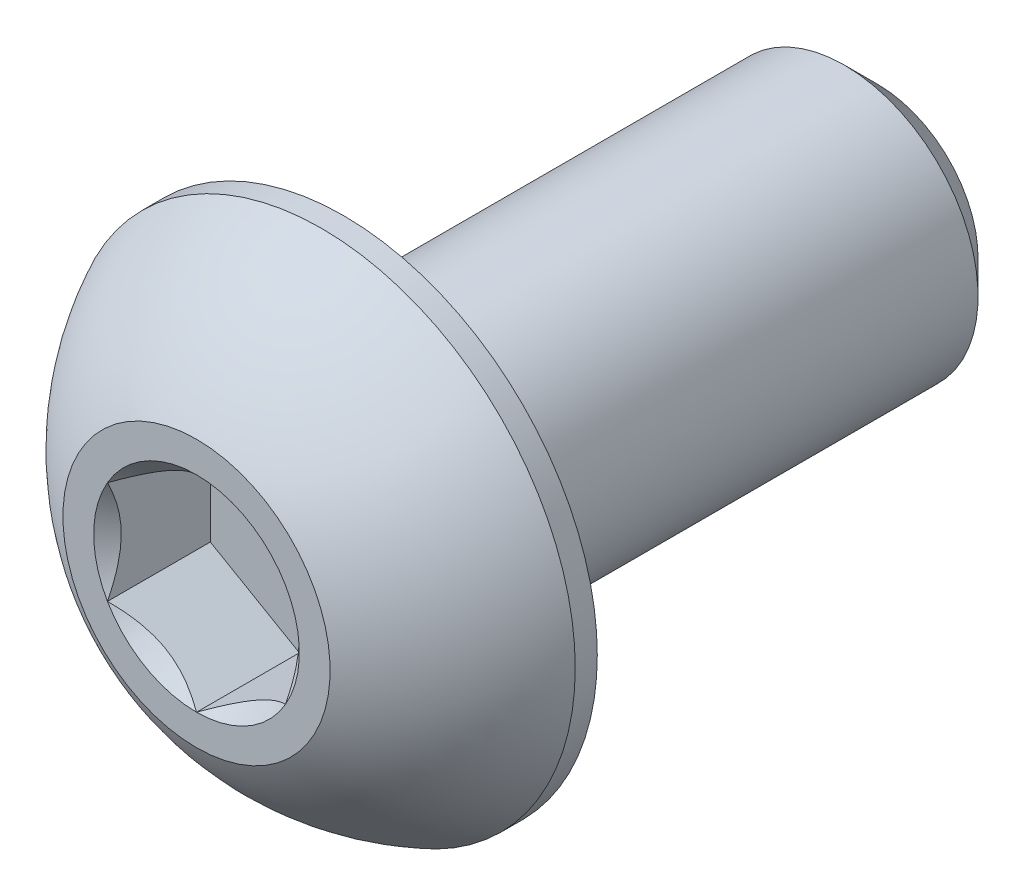
ISO-10303-21;
HEADER;
FILE_DESCRIPTION(('STEP AP214'),'2;1');
FILE_NAME('part.step','',(''),(''),'','','');
FILE_SCHEMA(('AUTOMOTIVE_DESIGN { 1 0 10303 214 1 1 1 1 }'));
ENDSEC;
DATA;
#1=APPLICATION_CONTEXT('core data for automotive mechanical design processes');
#2=APPLICATION_PROTOCOL_DEFINITION('international standard','automotive_design',2000,#1);
#3=PRODUCT_CONTEXT('',#1,'mechanical');
#4=PRODUCT('Part','Part','',(#3));
#5=PRODUCT_RELATED_PRODUCT_CATEGORY('part','',(#4));
#6=PRODUCT_DEFINITION_FORMATION('','',#4);
#7=PRODUCT_DEFINITION_CONTEXT('part definition',#1,'design');
#8=PRODUCT_DEFINITION('design','',#6,#7);
#9=PRODUCT_DEFINITION_SHAPE('','',#8);
#10=(LENGTH_UNIT() NAMED_UNIT(*) SI_UNIT(.MILLI.,.METRE.));
#11=(NAMED_UNIT(*) PLANE_ANGLE_UNIT() SI_UNIT($,.RADIAN.));
#12=(NAMED_UNIT(*) SI_UNIT($,.STERADIAN.) SOLID_ANGLE_UNIT());
#13=UNCERTAINTY_MEASURE_WITH_UNIT(LENGTH_MEASURE(1.E-05),#10,'distance_accuracy_value','');
#14=(GEOMETRIC_REPRESENTATION_CONTEXT(3) GLOBAL_UNCERTAINTY_ASSIGNED_CONTEXT((#13)) GLOBAL_UNIT_ASSIGNED_CONTEXT((#10,
#11,#12)) REPRESENTATION_CONTEXT('',''));
#15=CARTESIAN_POINT('',(0.,0.,0.));
#16=DIRECTION('',(0.,0.,1.));
#17=DIRECTION('',(1.,0.,0.));
#18=AXIS2_PLACEMENT_3D('',#15,#16,#17);
#19=CARTESIAN_POINT('',(0.,-1.50000000000001,-7.65));
#20=DIRECTION('',(0.,0.,-1.));
#21=DIRECTION('',(0.,1.,0.));
#22=AXIS2_PLACEMENT_3D('',#19,#20,#21);
#23=PLANE('',#22);
#24=CARTESIAN_POINT('',(0.,0.,-7.65));
#25=DIRECTION('',(0.,0.,-1.));
#26=DIRECTION('',(0.,1.,0.));
#27=AXIS2_PLACEMENT_3D('',#24,#25,#26);
#28=CIRCLE('',#27,1.12500000000001);
#29=CARTESIAN_POINT('',(0.,1.12500000000001,-7.65));
#30=VERTEX_POINT('',#29);
#31=EDGE_CURVE('E174',#30,#30,#28,.T.);
#32=ORIENTED_EDGE('',*,*,#31,.T.);
#33=EDGE_LOOP('',(#32));
#34=FACE_BOUND('',#33,.T.);
#35=ADVANCED_FACE('F35',(#34),#23,.T.);
#36=CARTESIAN_POINT('',(0.,0.,-7.65));
#37=DIRECTION('',(0.,0.,-1.));
#38=DIRECTION('',(0.,1.,0.));
#39=AXIS2_PLACEMENT_3D('',#36,#37,#38);
#40=CYLINDRICAL_SURFACE('',#39,1.50000000000001);
#41=CARTESIAN_POINT('',(0.,0.,-7.275));
#42=DIRECTION('',(0.,0.,-1.));
#43=DIRECTION('',(0.,1.,0.));
#44=AXIS2_PLACEMENT_3D('',#41,#42,#43);
#45=CIRCLE('',#44,1.50000000000001);
#46=CARTESIAN_POINT('',(0.,1.50000000000001,-7.275));
#47=VERTEX_POINT('',#46);
#48=EDGE_CURVE('E48',#47,#47,#45,.F.);
#49=ORIENTED_EDGE('',*,*,#48,.T.);
#50=EDGE_LOOP('',(#49));
#51=FACE_BOUND('',#50,.T.);
#52=CARTESIAN_POINT('',(0.,0.,-1.65));
#53=DIRECTION('',(0.,0.,1.));
#54=DIRECTION('',(1.,0.,0.));
#55=AXIS2_PLACEMENT_3D('',#52,#53,#54);
#56=CIRCLE('',#55,1.50000000000001);
#57=CARTESIAN_POINT('',(1.50000000000001,0.,-1.65));
#58=VERTEX_POINT('',#57);
#59=EDGE_CURVE('E171',#58,#58,#56,.F.);
#60=ORIENTED_EDGE('',*,*,#59,.T.);
#61=EDGE_LOOP('',(#60));
#62=FACE_BOUND('',#61,.T.);
#63=ADVANCED_FACE('F179',(#51,#62),#40,.T.);
#64=CARTESIAN_POINT('',(0.,0.,-7.65));
#65=DIRECTION('',(0.,0.,1.));
#66=DIRECTION('',(0.,-1.,0.));
#67=AXIS2_PLACEMENT_3D('',#64,#65,#66);
#68=CONICAL_SURFACE('',#67,1.12500000000001,0.785398163397448);
#69=ORIENTED_EDGE('',*,*,#48,.F.);
#70=EDGE_LOOP('',(#69));
#71=FACE_BOUND('',#70,.T.);
#72=ORIENTED_EDGE('',*,*,#31,.F.);
#73=EDGE_LOOP('',(#72));
#74=FACE_BOUND('',#73,.T.);
#75=ADVANCED_FACE('F37',(#71,#74),#68,.T.);
#76=CARTESIAN_POINT('',(0.,0.,-2.79483288770053));
#77=DIRECTION('',(0.,0.,1.));
#78=DIRECTION('',(0.,-1.,0.));
#79=AXIS2_PLACEMENT_3D('',#76,#77,#78);
#80=SPHERICAL_SURFACE('',#79,3.17192226735974);
#81=CARTESIAN_POINT('',(0.,0.,0.));
#82=DIRECTION('',(0.,0.,1.));
#83=DIRECTION('',(1.,0.,0.));
#84=AXIS2_PLACEMENT_3D('',#81,#82,#83);
#85=CIRCLE('',#84,1.50000000000001);
#86=CARTESIAN_POINT('',(0.,-1.50000000000001,0.));
#87=VERTEX_POINT('',#86);
#88=EDGE_CURVE('E168',#87,#87,#85,.T.);
#89=CARTESIAN_POINT('',(0.,0.,-1.4025));
#90=DIRECTION('',(0.,0.,1.));
#91=DIRECTION('',(1.,0.,0.));
#92=AXIS2_PLACEMENT_3D('',#89,#90,#91);
#93=CIRCLE('',#92,2.85);
#94=CARTESIAN_POINT('',(0.,-2.85,-1.4025));
#95=VERTEX_POINT('',#94);
#96=EDGE_CURVE('E162',#95,#95,#93,.T.);
#97=CARTESIAN_POINT('',(0.,-1.50000000000001,0.));
#98=CARTESIAN_POINT('',(0.,-1.51816007989211,-0.00974656947336552));
#99=CARTESIAN_POINT('',(0.,-1.53622513742981,-0.0196701847238479));
#100=CARTESIAN_POINT('',(0.,-1.57215840256595,-0.0398676311293124));
#101=CARTESIAN_POINT('',(0.,-1.59002661016438,-0.0501414622842946));
#102=CARTESIAN_POINT('',(0.,-1.62555937019151,-0.0710354648490241));
#103=CARTESIAN_POINT('',(0.,-1.6432239226202,-0.0816556362587713));
#104=CARTESIAN_POINT('',(0.,-1.67834266450262,-0.103238276426968));
#105=CARTESIAN_POINT('',(0.,-1.69579685395636,-0.114200745185417));
#106=CARTESIAN_POINT('',(0.,-1.73048823664554,-0.136463816635606));
#107=CARTESIAN_POINT('',(0.,-1.74772542988099,-0.147764419327347));
#108=CARTESIAN_POINT('',(0.,-1.78197627078177,-0.170699464187154));
#109=CARTESIAN_POINT('',(0.,-1.79898991844709,-0.182333906355219));
#110=CARTESIAN_POINT('',(0.,-1.83278720341135,-0.205932209546913));
#111=CARTESIAN_POINT('',(0.,-1.84957084071029,-0.217896070570541));
#112=CARTESIAN_POINT('',(0.,-1.88290172764636,-0.242148665498755));
#113=CARTESIAN_POINT('',(0.,-1.89944897728351,-0.254437399403342));
#114=CARTESIAN_POINT('',(0.,-1.93230080139369,-0.279335070725424));
#115=CARTESIAN_POINT('',(0.,-1.94860537586673,-0.29194400814292));
#116=CARTESIAN_POINT('',(0.,-1.98096565436365,-0.317477295441112));
#117=CARTESIAN_POINT('',(0.,-1.99702135838754,-0.330401645321808));
#118=CARTESIAN_POINT('',(0.,-2.02887779526297,-0.356560846652226));
#119=CARTESIAN_POINT('',(0.,-2.04467852811452,-0.369795698101949));
#120=CARTESIAN_POINT('',(0.,-2.07601901880464,-0.396570873693307));
#121=CARTESIAN_POINT('',(0.,-2.09155877664321,-0.410111197834943));
#122=CARTESIAN_POINT('',(0.,-2.12237141262985,-0.437492173862106));
#123=CARTESIAN_POINT('',(0.,-2.13764429077792,-0.451332825747634));
#124=CARTESIAN_POINT('',(0.,-2.16791736411296,-0.479309198198268));
#125=CARTESIAN_POINT('',(0.,-2.18291755929993,-0.493444918763375));
#126=CARTESIAN_POINT('',(0.,-2.21263956705415,-0.522006057390951));
#127=CARTESIAN_POINT('',(0.,-2.22736137962139,-0.536431475453419));
#128=CARTESIAN_POINT('',(0.,-2.25652102825521,-0.565566527816472));
#129=CARTESIAN_POINT('',(0.,-2.27095886432178,-0.580276162117055));
#130=CARTESIAN_POINT('',(0.,-2.2995450739765,-0.609974057702795));
#131=CARTESIAN_POINT('',(0.,-2.31369344756465,-0.624962318987952));
#132=CARTESIAN_POINT('',(0.,-2.34169535627252,-0.655211773418759));
#133=CARTESIAN_POINT('',(0.,-2.35554889139224,-0.67047296656441));
#134=CARTESIAN_POINT('',(0.,-2.38295585920366,-0.701262485885583));
#135=CARTESIAN_POINT('',(0.,-2.39650929189537,-0.716790812061105));
#136=CARTESIAN_POINT('',(0.,-2.42331090492182,-0.748108697108242));
#137=CARTESIAN_POINT('',(0.,-2.43655908525656,-0.763898255979858));
#138=CARTESIAN_POINT('',(0.,-2.46274515962755,-0.795732606824227));
#139=CARTESIAN_POINT('',(0.,-2.47568305366379,-0.811777398796981));
#140=CARTESIAN_POINT('',(0.,-2.50124363939651,-0.844116119267126));
#141=CARTESIAN_POINT('',(0.,-2.51386633109298,-0.860410047764518));
#142=CARTESIAN_POINT('',(0.,-2.53879171587279,-0.893240850042599));
#143=CARTESIAN_POINT('',(0.,-2.55109440895612,-0.909777723823286));
#144=CARTESIAN_POINT('',(0.,-2.57537512182785,-0.94308813311364));
#145=CARTESIAN_POINT('',(0.,-2.58735314161625,-0.959861668623305));
#146=CARTESIAN_POINT('',(0.,-2.61097995657956,-0.993639027894247));
#147=CARTESIAN_POINT('',(0.,-2.62262875175448,-1.01064285165552));
#148=CARTESIAN_POINT('',(0.,-2.64559269128199,-1.04487432644225));
#149=CARTESIAN_POINT('',(0.,-2.65690783563458,-1.06210197746771));
#150=CARTESIAN_POINT('',(0.,-2.67920017403639,-1.09677456077299));
#151=CARTESIAN_POINT('',(0.,-2.69017736808561,-1.11421949305282));
#152=CARTESIAN_POINT('',(0.,-2.711789634999,-1.14932001019995));
#153=CARTESIAN_POINT('',(0.,-2.72242470786316,-1.16697559506725));
#154=CARTESIAN_POINT('',(0.,-2.74334869082118,-1.20249070903943));
#155=CARTESIAN_POINT('',(0.,-2.75363760091502,-1.22035023814429));
#156=CARTESIAN_POINT('',(0.,-2.77386535089241,-1.25626645340824));
#157=CARTESIAN_POINT('',(0.,-2.78380419077596,-1.27432313956733));
#158=CARTESIAN_POINT('',(0.,-2.80332801615778,-1.31062681184411));
#159=CARTESIAN_POINT('',(0.,-2.81291300165605,-1.32887379796182));
#160=CARTESIAN_POINT('',(0.,-2.83172550494215,-1.3655511220839));
#161=CARTESIAN_POINT('',(0.,-2.84095302272998,-1.38398146008827));
#162=CARTESIAN_POINT('',(0.,-2.85,-1.4025));
#163=B_SPLINE_CURVE_WITH_KNOTS('',3,(#97,#98,#99,#100,#101,#102,#103,#104,#105,#106,#107,#108,
#109,#110,#111,#112,#113,#114,#115,#116,#117,#118,#119,#120,#121,#122,#123,#124,#125,#126,#127,
#128,#129,#130,#131,#132,#133,#134,#135,#136,#137,#138,#139,#140,#141,#142,#143,#144,#145,#146,
#147,#148,#149,#150,#151,#152,#153,#154,#155,#156,#157,#158,#159,#160,#161,#162),.UNSPECIFIED.,
.F.,.F.,(4,2,2,2,2,2,2,2,2,2,2,2,2,2,2,2,2,2,2,2,2,2,2,2,2,2,2,2,2,2,2,2,4),(0.,
0.0618298941826982,0.123659788365396,0.185489682548094,0.247319576730793,0.30914947091349,
0.370979365096189,0.432809259278887,0.494639153461585,0.556469047644283,0.618298941826981,
0.680128836009679,0.741958730192377,0.803788624375075,0.865618518557773,0.927448412740472,
0.98927830692317,1.05110820110587,1.11293809528857,1.17476798947126,1.23659788365396,
1.29842777783666,1.36025767201936,1.42208756620206,1.48391746038475,1.54574735456745,
1.60757724875015,1.66940714293285,1.73123703711555,1.79306693129824,1.85489682548094,
1.91672671966364,1.97855661384634),.UNSPECIFIED.);
#164=EDGE_CURVE('BSEAM184',#87,#95,#163,.T.);
#165=ORIENTED_EDGE('',*,*,#88,.F.);
#166=ORIENTED_EDGE('',*,*,#96,.T.);
#167=ORIENTED_EDGE('',*,*,#164,.T.);
#168=ORIENTED_EDGE('',*,*,#164,.F.);
#169=EDGE_LOOP('',(#165,#167,#166,#168));
#170=FACE_BOUND('',#169,.T.);
#171=ADVANCED_FACE('F184',(#170),#80,.T.);
#172=CARTESIAN_POINT('',(0.,-1.50000000000001,0.));
#173=DIRECTION('',(0.,0.,-1.));
#174=DIRECTION('',(-1.,0.,0.));
#175=AXIS2_PLACEMENT_3D('',#172,#173,#174);
#176=PLANE('',#175);
#177=CARTESIAN_POINT('',(0.,0.,0.));
#178=DIRECTION('',(0.,0.,1.));
#179=DIRECTION('',(1.,0.,0.));
#180=AXIS2_PLACEMENT_3D('',#177,#178,#179);
#181=CIRCLE('',#180,1.15470053837925);
#182=CARTESIAN_POINT('',(-0.999999999999998,0.577350269189625,0.));
#183=VERTEX_POINT('',#182);
#184=CARTESIAN_POINT('',(-0.999999999999997,-0.577350269189627,0.));
#185=VERTEX_POINT('',#184);
#186=EDGE_CURVE('E61',#183,#185,#181,.T.);
#187=ORIENTED_EDGE('',*,*,#186,.F.);
#188=CARTESIAN_POINT('',(0.,1.15470053837925,0.));
#189=VERTEX_POINT('',#188);
#190=EDGE_CURVE('E133',#189,#183,#181,.T.);
#191=ORIENTED_EDGE('',*,*,#190,.F.);
#192=CARTESIAN_POINT('',(1.,0.577350269189622,0.));
#193=VERTEX_POINT('',#192);
#194=EDGE_CURVE('E130',#193,#189,#181,.T.);
#195=ORIENTED_EDGE('',*,*,#194,.F.);
#196=CARTESIAN_POINT('',(1.,-0.577350269189622,0.));
#197=VERTEX_POINT('',#196);
#198=EDGE_CURVE('E101',#197,#193,#181,.T.);
#199=ORIENTED_EDGE('',*,*,#198,.F.);
#200=CARTESIAN_POINT('',(0.,-1.15470053837925,0.));
#201=VERTEX_POINT('',#200);
#202=EDGE_CURVE('E93',#201,#197,#181,.T.);
#203=ORIENTED_EDGE('',*,*,#202,.F.);
#204=EDGE_CURVE('E54',#185,#201,#181,.T.);
#205=ORIENTED_EDGE('',*,*,#204,.F.);
#206=EDGE_LOOP('',(#187,#191,#195,#199,#203,#205));
#207=FACE_BOUND('',#206,.T.);
#208=ORIENTED_EDGE('',*,*,#88,.T.);
#209=EDGE_LOOP('',(#208));
#210=FACE_BOUND('',#209,.T.);
#211=ADVANCED_FACE('F127',(#207,#210),#176,.F.);
#212=CARTESIAN_POINT('',(0.,-2.85,-1.65));
#213=DIRECTION('',(0.,0.,1.));
#214=DIRECTION('',(1.,0.,0.));
#215=AXIS2_PLACEMENT_3D('',#212,#213,#214);
#216=PLANE('',#215);
#217=ORIENTED_EDGE('',*,*,#59,.F.);
#218=EDGE_LOOP('',(#217));
#219=FACE_BOUND('',#218,.T.);
#220=CARTESIAN_POINT('',(0.,0.,-1.65));
#221=DIRECTION('',(0.,0.,1.));
#222=DIRECTION('',(1.,0.,0.));
#223=AXIS2_PLACEMENT_3D('',#220,#221,#222);
#224=CIRCLE('',#223,2.85);
#225=CARTESIAN_POINT('',(2.85,0.,-1.65));
#226=VERTEX_POINT('',#225);
#227=EDGE_CURVE('E165',#226,#226,#224,.T.);
#228=ORIENTED_EDGE('',*,*,#227,.F.);
#229=EDGE_LOOP('',(#228));
#230=FACE_BOUND('',#229,.T.);
#231=ADVANCED_FACE('F198',(#219,#230),#216,.F.);
#232=CARTESIAN_POINT('',(0.,0.,0.));
#233=DIRECTION('',(0.,0.,1.));
#234=DIRECTION('',(1.,0.,0.));
#235=AXIS2_PLACEMENT_3D('',#232,#233,#234);
#236=CYLINDRICAL_SURFACE('',#235,2.85);
#237=ORIENTED_EDGE('',*,*,#96,.F.);
#238=EDGE_LOOP('',(#237));
#239=FACE_BOUND('',#238,.T.);
#240=ORIENTED_EDGE('',*,*,#227,.T.);
#241=EDGE_LOOP('',(#240));
#242=FACE_BOUND('',#241,.T.);
#243=ADVANCED_FACE('F201',(#239,#242),#236,.T.);
#244=CARTESIAN_POINT('',(0.,0.,0.));
#245=DIRECTION('',(0.,0.,1.));
#246=DIRECTION('',(1.,0.,0.));
#247=AXIS2_PLACEMENT_3D('',#244,#245,#246);
#248=CONICAL_SURFACE('',#247,1.15470053837925,0.78539816339745);
#249=ORIENTED_EDGE('',*,*,#198,.T.);
#250=CARTESIAN_POINT('',(1.,-1.15147208646461,0.370385677513858));
#251=CARTESIAN_POINT('',(1.,-1.12343447988551,0.349219919873709));
#252=CARTESIAN_POINT('',(1.,-1.09524064850697,0.328261692175907));
#253=CARTESIAN_POINT('',(1.,-1.03847715644376,0.286846022235619));
#254=CARTESIAN_POINT('',(1.,-1.00990740382974,0.266388706123656));
#255=CARTESIAN_POINT('',(1.,-0.923120894333472,0.205604794954507));
#256=CARTESIAN_POINT('',(1.,-0.864253173759055,0.166192228961396));
#257=CARTESIAN_POINT('',(1.,-0.740809858258041,0.0888206642002037));
#258=CARTESIAN_POINT('',(1.,-0.676100255137803,0.0510730391143412));
#259=CARTESIAN_POINT('',(1.,-0.543448939049121,-0.0179754124487086));
#260=CARTESIAN_POINT('',(1.,-0.475519112027776,-0.0492979721531345));
#261=CARTESIAN_POINT('',(1.,-0.373555850333526,-0.0876182211162046));
#262=CARTESIAN_POINT('',(1.,-0.341031989670905,-0.0986164083578431));
#263=CARTESIAN_POINT('',(1.,-0.275199079052291,-0.118001657852639));
#264=CARTESIAN_POINT('',(1.,-0.241889975173931,-0.1263885402233));
#265=CARTESIAN_POINT('',(1.,-0.175247517042991,-0.139974779280983));
#266=CARTESIAN_POINT('',(1.,-0.141925568218173,-0.145229209232031));
#267=CARTESIAN_POINT('',(1.,-0.0749144362322775,-0.152451313429106));
#268=CARTESIAN_POINT('',(1.,-0.0412251978501604,-0.154418486389491));
#269=CARTESIAN_POINT('',(1.,0.0249580992634221,-0.154916801606838));
#270=CARTESIAN_POINT('',(1.,0.0574512826460403,-0.153569732111364));
#271=CARTESIAN_POINT('',(1.,0.122148505701868,-0.147783515501014));
#272=CARTESIAN_POINT('',(1.,0.154352610132927,-0.143345079338463));
#273=CARTESIAN_POINT('',(1.,0.21879989886764,-0.131543169854794));
#274=CARTESIAN_POINT('',(1.,0.251033743268954,-0.124129458961489));
#275=CARTESIAN_POINT('',(1.,0.314797132354919,-0.106771057501323));
#276=CARTESIAN_POINT('',(1.,0.346326735731005,-0.0968265787111686));
#277=CARTESIAN_POINT('',(1.,0.445594187730205,-0.0617765174456617));
#278=CARTESIAN_POINT('',(1.,0.511919139476037,-0.0326791416432738));
#279=CARTESIAN_POINT('',(1.,0.641453244657533,0.0320153296865065));
#280=CARTESIAN_POINT('',(1.,0.704650133126345,0.0676357767152436));
#281=CARTESIAN_POINT('',(1.,0.825428490174987,0.141123901346937));
#282=CARTESIAN_POINT('',(1.,0.883132947867685,0.178791947135465));
#283=CARTESIAN_POINT('',(1.,0.968148853704566,0.237022852943165));
#284=CARTESIAN_POINT('',(1.,0.996120570380285,0.256638475762858));
#285=CARTESIAN_POINT('',(1.,1.05168177729902,0.296388517061273));
#286=CARTESIAN_POINT('',(1.,1.079271369977,0.316522792198834));
#287=CARTESIAN_POINT('',(1.,1.10670185346329,0.336872119072974));
#288=B_SPLINE_CURVE_WITH_KNOTS('',3,(#250,#251,#252,#253,#254,#255,#256,#257,#258,#259,#260,
#261,#262,#263,#264,#265,#266,#267,#268,#269,#270,#271,#272,#273,#274,#275,#276,#277,#278,#279,
#280,#281,#282,#283,#284,#285,#286,#287),.UNSPECIFIED.,.F.,.F.,(4,2,2,2,2,2,2,2,2,2,2,2,2,2,2,2,
2,2,4),(0.,0.10538645908329,0.210799187330123,0.423233611565467,0.6477935409085,
0.871580877738606,0.974493074181416,1.07741235827201,1.17846428203204,1.27953161415762,
1.3769408673961,1.47432772585407,1.57343322804293,1.67253043972851,1.88917353996827,
2.10660791038812,2.31323734249843,2.41572589232044,2.51818641476503),.UNSPECIFIED.);
#289=EDGE_CURVE('E11',#197,#193,#288,.T.);
#290=ORIENTED_EDGE('',*,*,#289,.F.);
#291=EDGE_LOOP('',(#249,#290));
#292=FACE_BOUND('',#291,.T.);
#293=ADVANCED_FACE('F105',(#292),#248,.F.);
#294=ORIENTED_EDGE('',*,*,#194,.T.);
#295=CARTESIAN_POINT('',(1.0002,0.577234799135787,0.000115487372615524));
#296=CARTESIAN_POINT('',(0.96581740499282,0.597085599618621,-0.0197220691742657));
#297=CARTESIAN_POINT('',(0.930859881860175,0.617268335009455,-0.0383949793611099));
#298=CARTESIAN_POINT('',(0.85957719704391,0.658423412276685,-0.072585257276841));
#299=CARTESIAN_POINT('',(0.823245249471016,0.679399671988079,-0.0880835909765403));
#300=CARTESIAN_POINT('',(0.749983386196688,0.721697428470846,-0.114632692857734));
#301=CARTESIAN_POINT('',(0.713072148554585,0.743008141459636,-0.125750226003073));
#302=CARTESIAN_POINT('',(0.63843727068914,0.786098608286186,-0.142880134223818));
#303=CARTESIAN_POINT('',(0.600715911891363,0.80787704494228,-0.148905302533327));
#304=CARTESIAN_POINT('',(0.535707801582066,0.845409494928862,-0.154339445032506));
#305=CARTESIAN_POINT('',(0.508505628471827,0.861114676896601,-0.155143061683267));
#306=CARTESIAN_POINT('',(0.454153959330887,0.892494627706028,-0.153793300583112));
#307=CARTESIAN_POINT('',(0.427004476245123,0.908169389073953,-0.1516392704528));
#308=CARTESIAN_POINT('',(0.345943722673039,0.95496983696951,-0.140883027871528));
#309=CARTESIAN_POINT('',(0.292435859021572,0.985862616452446,-0.127985443584644));
#310=CARTESIAN_POINT('',(0.198523934856568,1.04008269114923,-0.0968592693978225));
#311=CARTESIAN_POINT('',(0.157679476328165,1.0636642502755,-0.0802622022981604));
#312=CARTESIAN_POINT('',(0.0775903626180562,1.10990372163519,-0.042875075314707));
#313=CARTESIAN_POINT('',(0.0383409891295623,1.1325643579843,-0.0220986581825964));
#314=CARTESIAN_POINT('',(-0.00019999999999987,1.15481600843309,0.000115487372613997));
#315=B_SPLINE_CURVE_WITH_KNOTS('',3,(#295,#296,#297,#298,#299,#300,#301,#302,#303,#304,#305,
#306,#307,#308,#309,#310,#311,#312,#313,#314),.UNSPECIFIED.,.F.,.F.,(4,2,2,2,2,2,2,2,2,4),(0.,
0.13323767682856,0.267252229834491,0.399137076269301,0.53068960328077,0.624814864263848,
0.718960890149135,0.907306626112099,1.05710100361789,1.20641411519286),.UNSPECIFIED.);
#316=EDGE_CURVE('E132',#193,#189,#315,.T.);
#317=ORIENTED_EDGE('',*,*,#316,.F.);
#318=EDGE_LOOP('',(#294,#317));
#319=FACE_BOUND('',#318,.T.);
#320=ADVANCED_FACE('F281',(#319),#248,.F.);
#321=ORIENTED_EDGE('',*,*,#190,.T.);
#322=CARTESIAN_POINT('',(0.000199999999999979,1.15481600843309,0.000115487372613877));
#323=CARTESIAN_POINT('',(-0.0341825950071807,1.13496520795025,-0.0197220691742669));
#324=CARTESIAN_POINT('',(-0.0691401181398249,1.11478247255942,-0.0383949793611111));
#325=CARTESIAN_POINT('',(-0.14042280295609,1.07362739529219,-0.0725852572768421));
#326=CARTESIAN_POINT('',(-0.176754750528984,1.0526511355808,-0.0880835909765414));
#327=CARTESIAN_POINT('',(-0.250016613803311,1.01035337909803,-0.114632692857735));
#328=CARTESIAN_POINT('',(-0.286927851445414,0.989042666109239,-0.125750226003074));
#329=CARTESIAN_POINT('',(-0.361562729310859,0.94595219928269,-0.142880134223818));
#330=CARTESIAN_POINT('',(-0.399284088108636,0.924173762626595,-0.148905302533327));
#331=CARTESIAN_POINT('',(-0.464292198417933,0.886641312640013,-0.154339445032506));
#332=CARTESIAN_POINT('',(-0.491494371528172,0.870936130672274,-0.155143061683268));
#333=CARTESIAN_POINT('',(-0.545846040669112,0.839556179862847,-0.153793300583113));
#334=CARTESIAN_POINT('',(-0.572995523754875,0.823881418494922,-0.1516392704528));
#335=CARTESIAN_POINT('',(-0.65405627732696,0.777080970599365,-0.140883027871529));
#336=CARTESIAN_POINT('',(-0.707564140978427,0.746188191116429,-0.127985443584644));
#337=CARTESIAN_POINT('',(-0.801476065143431,0.691968116419648,-0.0968592693978226));
#338=CARTESIAN_POINT('',(-0.842320523671833,0.66838655729337,-0.0802622022981606));
#339=CARTESIAN_POINT('',(-0.922409637381942,0.62214708593368,-0.0428750753147074));
#340=CARTESIAN_POINT('',(-0.961659010870436,0.599486449584574,-0.022098658182597));
#341=CARTESIAN_POINT('',(-1.0002,0.577234799135787,0.000115487372613407));
#342=B_SPLINE_CURVE_WITH_KNOTS('',3,(#322,#323,#324,#325,#326,#327,#328,#329,#330,#331,#332,
#333,#334,#335,#336,#337,#338,#339,#340,#341),.UNSPECIFIED.,.F.,.F.,(4,2,2,2,2,2,2,2,2,4),(0.,
0.133237676828559,0.26725222983449,0.3991370762693,0.530689603280768,0.624814864263846,
0.718960890149133,0.907306626112097,1.05710100361789,1.20641411519286),.UNSPECIFIED.);
#343=EDGE_CURVE('E137',#189,#183,#342,.T.);
#344=ORIENTED_EDGE('',*,*,#343,.F.);
#345=EDGE_LOOP('',(#321,#344));
#346=FACE_BOUND('',#345,.T.);
#347=ADVANCED_FACE('F140',(#346),#248,.F.);
#348=ORIENTED_EDGE('',*,*,#186,.T.);
#349=CARTESIAN_POINT('',(-0.999999999999997,-1.15147208646462,0.37038567751386));
#350=CARTESIAN_POINT('',(-0.999999999999997,-1.12343447988552,0.349219919873711));
#351=CARTESIAN_POINT('',(-0.999999999999997,-1.09524064850697,0.328261692175909));
#352=CARTESIAN_POINT('',(-0.999999999999997,-1.03847715644376,0.28684602223562));
#353=CARTESIAN_POINT('',(-0.999999999999997,-1.00990740382975,0.266388706123657));
#354=CARTESIAN_POINT('',(-0.999999999999997,-0.923120894333476,0.205604794954508));
#355=CARTESIAN_POINT('',(-0.999999999999997,-0.864253173759059,0.166192228961396));
#356=CARTESIAN_POINT('',(-0.999999999999997,-0.740809858258045,0.0888206642002038));
#357=CARTESIAN_POINT('',(-0.999999999999997,-0.676100255137807,0.0510730391143411));
#358=CARTESIAN_POINT('',(-0.999999999999997,-0.543448939049124,-0.0179754124487093));
#359=CARTESIAN_POINT('',(-0.999999999999997,-0.475519112027779,-0.0492979721531356));
#360=CARTESIAN_POINT('',(-0.999999999999997,-0.373555850333529,-0.087618221116206));
#361=CARTESIAN_POINT('',(-0.999999999999997,-0.341031989670908,-0.0986164083578446));
#362=CARTESIAN_POINT('',(-0.999999999999997,-0.275199079052294,-0.118001657852641));
#363=CARTESIAN_POINT('',(-0.999999999999998,-0.241889975173933,-0.126388540223302));
#364=CARTESIAN_POINT('',(-0.999999999999998,-0.175247517042993,-0.139974779280985));
#365=CARTESIAN_POINT('',(-0.999999999999998,-0.141925568218176,-0.145229209232034));
#366=CARTESIAN_POINT('',(-0.999999999999998,-0.0749144362322798,-0.152451313429109));
#367=CARTESIAN_POINT('',(-0.999999999999998,-0.0412251978501626,-0.154418486389493));
#368=CARTESIAN_POINT('',(-0.999999999999998,0.02495809926342,-0.15491680160684));
#369=CARTESIAN_POINT('',(-0.999999999999998,0.0574512826460382,-0.153569732111367));
#370=CARTESIAN_POINT('',(-0.999999999999998,0.122148505701866,-0.147783515501017));
#371=CARTESIAN_POINT('',(-0.999999999999998,0.154352610132925,-0.143345079338466));
#372=CARTESIAN_POINT('',(-0.999999999999998,0.218799898867638,-0.131543169854798));
#373=CARTESIAN_POINT('',(-0.999999999999998,0.251033743268952,-0.124129458961492));
#374=CARTESIAN_POINT('',(-0.999999999999998,0.314797132354917,-0.106771057501326));
#375=CARTESIAN_POINT('',(-0.999999999999998,0.346326735731003,-0.0968265787111718));
#376=CARTESIAN_POINT('',(-0.999999999999998,0.445594187730203,-0.0617765174456652));
#377=CARTESIAN_POINT('',(-0.999999999999998,0.511919139476034,-0.0326791416432775));
#378=CARTESIAN_POINT('',(-0.999999999999998,0.641453244657529,0.0320153296865025));
#379=CARTESIAN_POINT('',(-0.999999999999998,0.704650133126341,0.0676357767152393));
#380=CARTESIAN_POINT('',(-0.999999999999998,0.825428490174983,0.141123901346932));
#381=CARTESIAN_POINT('',(-0.999999999999998,0.883132947867681,0.17879194713546));
#382=CARTESIAN_POINT('',(-0.999999999999998,0.968148853704561,0.23702285294316));
#383=CARTESIAN_POINT('',(-0.999999999999998,0.996120570380281,0.256638475762853));
#384=CARTESIAN_POINT('',(-0.999999999999998,1.05168177729901,0.296388517061267));
#385=CARTESIAN_POINT('',(-0.999999999999998,1.079271369977,0.316522792198828));
#386=CARTESIAN_POINT('',(-0.999999999999998,1.10670185346329,0.336872119072968));
#387=B_SPLINE_CURVE_WITH_KNOTS('',3,(#349,#350,#351,#352,#353,#354,#355,#356,#357,#358,#359,
#360,#361,#362,#363,#364,#365,#366,#367,#368,#369,#370,#371,#372,#373,#374,#375,#376,#377,#378,
#379,#380,#381,#382,#383,#384,#385,#386),.UNSPECIFIED.,.F.,.F.,(4,2,2,2,2,2,2,2,2,2,2,2,2,2,2,2,
2,2,4),(0.,0.105386459083291,0.210799187330124,0.423233611565469,0.647793540908503,
0.871580877738609,0.97449307418142,1.07741235827201,1.17846428203205,1.27953161415762,
1.3769408673961,1.47432772585408,1.57343322804293,1.67253043972851,1.88917353996827,
2.10660791038812,2.31323734249843,2.41572589232044,2.51818641476503),.UNSPECIFIED.);
#388=EDGE_CURVE('E144',#183,#185,#387,.F.);
#389=ORIENTED_EDGE('',*,*,#388,.F.);
#390=EDGE_LOOP('',(#348,#389));
#391=FACE_BOUND('',#390,.T.);
#392=ADVANCED_FACE('F275',(#391),#248,.F.);
#393=ORIENTED_EDGE('',*,*,#204,.T.);
#394=CARTESIAN_POINT('',(-1.0002,-0.577234799135788,0.000115487372613356));
#395=CARTESIAN_POINT('',(-0.965817404992817,-0.597085599618622,-0.0197220691742676));
#396=CARTESIAN_POINT('',(-0.930859881860173,-0.617268335009456,-0.0383949793611116));
#397=CARTESIAN_POINT('',(-0.859577197043908,-0.658423412276686,-0.0725852572768423));
#398=CARTESIAN_POINT('',(-0.823245249471014,-0.67939967198808,-0.0880835909765415));
#399=CARTESIAN_POINT('',(-0.749983386196687,-0.721697428470846,-0.114632692857735));
#400=CARTESIAN_POINT('',(-0.713072148554584,-0.743008141459636,-0.125750226003074));
#401=CARTESIAN_POINT('',(-0.638437270689139,-0.786098608286185,-0.142880134223818));
#402=CARTESIAN_POINT('',(-0.600715911891363,-0.80787704494228,-0.148905302533327));
#403=CARTESIAN_POINT('',(-0.535707801582065,-0.845409494928862,-0.154339445032506));
#404=CARTESIAN_POINT('',(-0.508505628471826,-0.861114676896601,-0.155143061683268));
#405=CARTESIAN_POINT('',(-0.454153959330887,-0.892494627706028,-0.153793300583113));
#406=CARTESIAN_POINT('',(-0.427004476245123,-0.908169389073953,-0.151639270452801));
#407=CARTESIAN_POINT('',(-0.345943722673038,-0.95496983696951,-0.140883027871529));
#408=CARTESIAN_POINT('',(-0.292435859021571,-0.985862616452446,-0.127985443584644));
#409=CARTESIAN_POINT('',(-0.198523934856567,-1.04008269114923,-0.0968592693978227));
#410=CARTESIAN_POINT('',(-0.157679476328165,-1.0636642502755,-0.0802622022981606));
#411=CARTESIAN_POINT('',(-0.0775903626180559,-1.10990372163519,-0.0428750753147073));
#412=CARTESIAN_POINT('',(-0.038340989129562,-1.1325643579843,-0.0220986581825969));
#413=CARTESIAN_POINT('',(0.00020000000000005,-1.15481600843309,0.000115487372613604));
#414=B_SPLINE_CURVE_WITH_KNOTS('',3,(#394,#395,#396,#397,#398,#399,#400,#401,#402,#403,#404,
#405,#406,#407,#408,#409,#410,#411,#412,#413),.UNSPECIFIED.,.F.,.F.,(4,2,2,2,2,2,2,2,2,4),(0.,
0.133237676828559,0.267252229834489,0.399137076269299,0.530689603280766,0.624814864263844,
0.718960890149131,0.907306626112095,1.05710100361789,1.20641411519286),.UNSPECIFIED.);
#415=EDGE_CURVE('E117',#185,#201,#414,.T.);
#416=ORIENTED_EDGE('',*,*,#415,.F.);
#417=EDGE_LOOP('',(#393,#416));
#418=FACE_BOUND('',#417,.T.);
#419=ADVANCED_FACE('F226',(#418),#248,.F.);
#420=ORIENTED_EDGE('',*,*,#202,.T.);
#421=CARTESIAN_POINT('',(-0.000199999999999918,-1.15481600843309,0.000115487372613444));
#422=CARTESIAN_POINT('',(0.0341825950071806,-1.13496520795025,-0.0197220691742676));
#423=CARTESIAN_POINT('',(0.0691401181398247,-1.11478247255942,-0.0383949793611117));
#424=CARTESIAN_POINT('',(0.140422802956089,-1.07362739529219,-0.0725852572768425));
#425=CARTESIAN_POINT('',(0.176754750528984,-1.0526511355808,-0.0880835909765417));
#426=CARTESIAN_POINT('',(0.250016613803311,-1.01035337909803,-0.114632692857735));
#427=CARTESIAN_POINT('',(0.286927851445414,-0.989042666109239,-0.125750226003074));
#428=CARTESIAN_POINT('',(0.361562729310858,-0.945952199282689,-0.142880134223818));
#429=CARTESIAN_POINT('',(0.399284088108635,-0.924173762626595,-0.148905302533328));
#430=CARTESIAN_POINT('',(0.464292198417932,-0.886641312640013,-0.154339445032507));
#431=CARTESIAN_POINT('',(0.491494371528171,-0.870936130672274,-0.155143061683268));
#432=CARTESIAN_POINT('',(0.545846040669111,-0.839556179862847,-0.153793300583113));
#433=CARTESIAN_POINT('',(0.572995523754874,-0.823881418494922,-0.151639270452801));
#434=CARTESIAN_POINT('',(0.654056277326958,-0.777080970599365,-0.14088302787153));
#435=CARTESIAN_POINT('',(0.707564140978426,-0.746188191116429,-0.127985443584645));
#436=CARTESIAN_POINT('',(0.80147606514343,-0.691968116419648,-0.0968592693978236));
#437=CARTESIAN_POINT('',(0.842320523671833,-0.66838655729337,-0.0802622022981612));
#438=CARTESIAN_POINT('',(0.922409637381943,-0.622147085933679,-0.0428750753147072));
#439=CARTESIAN_POINT('',(0.961659010870437,-0.599486449584573,-0.0220986581825964));
#440=CARTESIAN_POINT('',(1.0002,-0.577234799135785,0.000115487372614275));
#441=B_SPLINE_CURVE_WITH_KNOTS('',3,(#421,#422,#423,#424,#425,#426,#427,#428,#429,#430,#431,
#432,#433,#434,#435,#436,#437,#438,#439,#440),.UNSPECIFIED.,.F.,.F.,(4,2,2,2,2,2,2,2,2,4),(0.,
0.133237676828559,0.267252229834489,0.399137076269299,0.530689603280767,0.624814864263845,
0.718960890149131,0.907306626112095,1.05710100361789,1.20641411519286),.UNSPECIFIED.);
#442=EDGE_CURVE('E97',#201,#197,#441,.T.);
#443=ORIENTED_EDGE('',*,*,#442,.F.);
#444=EDGE_LOOP('',(#420,#443));
#445=FACE_BOUND('',#444,.T.);
#446=ADVANCED_FACE('F95',(#445),#248,.F.);
#447=CARTESIAN_POINT('',(1.,-0.577350269189623,-1.155));
#448=DIRECTION('',(0.,0.,1.));
#449=DIRECTION('',(1.,0.,0.));
#450=AXIS2_PLACEMENT_3D('',#447,#448,#449);
#451=PLANE('',#450);
#452=DIRECTION('',(0.866025403784438,0.5,0.));
#453=VECTOR('',#452,1.);
#454=CARTESIAN_POINT('',(0.,-1.15470053837925,-1.155));
#455=LINE('',#454,#453);
#456=CARTESIAN_POINT('',(0.,-1.15470053837925,-1.155));
#457=VERTEX_POINT('',#456);
#458=CARTESIAN_POINT('',(1.,-0.577350269189623,-1.155));
#459=VERTEX_POINT('',#458);
#460=EDGE_CURVE('E116',#457,#459,#455,.T.);
#461=ORIENTED_EDGE('',*,*,#460,.T.);
#462=DIRECTION('',(0.,1.,0.));
#463=VECTOR('',#462,1.);
#464=CARTESIAN_POINT('',(1.,-0.577350269189623,-1.155));
#465=LINE('',#464,#463);
#466=CARTESIAN_POINT('',(1.,0.577350269189625,-1.155));
#467=VERTEX_POINT('',#466);
#468=EDGE_CURVE('E121',#459,#467,#465,.T.);
#469=ORIENTED_EDGE('',*,*,#468,.T.);
#470=DIRECTION('',(-0.866025403784439,0.499999999999999,0.));
#471=VECTOR('',#470,1.);
#472=CARTESIAN_POINT('',(1.,0.577350269189625,-1.155));
#473=LINE('',#472,#471);
#474=CARTESIAN_POINT('',(0.,1.15470053837925,-1.155));
#475=VERTEX_POINT('',#474);
#476=EDGE_CURVE('E265',#467,#475,#473,.T.);
#477=ORIENTED_EDGE('',*,*,#476,.T.);
#478=DIRECTION('',(-0.866025403784439,-0.5,0.));
#479=VECTOR('',#478,1.);
#480=CARTESIAN_POINT('',(0.,1.15470053837925,-1.155));
#481=LINE('',#480,#479);
#482=CARTESIAN_POINT('',(-0.999999999999998,0.577350269189625,-1.155));
#483=VERTEX_POINT('',#482);
#484=EDGE_CURVE('E153',#475,#483,#481,.T.);
#485=ORIENTED_EDGE('',*,*,#484,.T.);
#486=DIRECTION('',(0.,-1.,0.));
#487=VECTOR('',#486,1.);
#488=CARTESIAN_POINT('',(-0.999999999999998,0.577350269189625,-1.155));
#489=LINE('',#488,#487);
#490=CARTESIAN_POINT('',(-0.999999999999997,-0.577350269189626,-1.155));
#491=VERTEX_POINT('',#490);
#492=EDGE_CURVE('E269',#483,#491,#489,.T.);
#493=ORIENTED_EDGE('',*,*,#492,.T.);
#494=DIRECTION('',(0.866025403784439,-0.5,0.));
#495=VECTOR('',#494,1.);
#496=CARTESIAN_POINT('',(-0.999999999999997,-0.577350269189626,-1.155));
#497=LINE('',#496,#495);
#498=EDGE_CURVE('E124',#491,#457,#497,.T.);
#499=ORIENTED_EDGE('',*,*,#498,.T.);
#500=EDGE_LOOP('',(#461,#469,#477,#485,#493,#499));
#501=FACE_BOUND('',#500,.T.);
#502=ADVANCED_FACE('F225',(#501),#451,.T.);
#503=CARTESIAN_POINT('',(1.,-0.577350269189623,-1.155));
#504=DIRECTION('',(1.,0.,0.));
#505=DIRECTION('',(0.,1.,0.));
#506=AXIS2_PLACEMENT_3D('',#503,#504,#505);
#507=PLANE('',#506);
#508=DIRECTION('',(0.,0.,1.));
#509=VECTOR('',#508,1.);
#510=CARTESIAN_POINT('',(1.,-0.577350269189623,-1.155));
#511=LINE('',#510,#509);
#512=EDGE_CURVE('E113',#459,#197,#511,.T.);
#513=ORIENTED_EDGE('',*,*,#512,.T.);
#514=ORIENTED_EDGE('',*,*,#289,.T.);
#515=DIRECTION('',(0.,0.,1.));
#516=VECTOR('',#515,1.);
#517=CARTESIAN_POINT('',(1.,0.577350269189625,-1.155));
#518=LINE('',#517,#516);
#519=EDGE_CURVE('E123',#467,#193,#518,.T.);
#520=ORIENTED_EDGE('',*,*,#519,.F.);
#521=ORIENTED_EDGE('',*,*,#468,.F.);
#522=EDGE_LOOP('',(#513,#514,#520,#521));
#523=FACE_BOUND('',#522,.T.);
#524=ADVANCED_FACE('F119',(#523),#507,.F.);
#525=CARTESIAN_POINT('',(1.,0.577350269189625,-1.155));
#526=DIRECTION('',(0.499999999999999,0.866025403784439,0.));
#527=DIRECTION('',(-0.866025403784439,0.499999999999999,0.));
#528=AXIS2_PLACEMENT_3D('',#525,#526,#527);
#529=PLANE('',#528);
#530=ORIENTED_EDGE('',*,*,#519,.T.);
#531=ORIENTED_EDGE('',*,*,#316,.T.);
#532=DIRECTION('',(0.,0.,1.));
#533=VECTOR('',#532,1.);
#534=CARTESIAN_POINT('',(0.,1.15470053837925,-1.155));
#535=LINE('',#534,#533);
#536=EDGE_CURVE('E149',#475,#189,#535,.T.);
#537=ORIENTED_EDGE('',*,*,#536,.F.);
#538=ORIENTED_EDGE('',*,*,#476,.F.);
#539=EDGE_LOOP('',(#530,#531,#537,#538));
#540=FACE_BOUND('',#539,.T.);
#541=ADVANCED_FACE('F147',(#540),#529,.F.);
#542=CARTESIAN_POINT('',(0.,1.15470053837925,-1.155));
#543=DIRECTION('',(-0.5,0.866025403784439,0.));
#544=DIRECTION('',(-0.866025403784439,-0.5,0.));
#545=AXIS2_PLACEMENT_3D('',#542,#543,#544);
#546=PLANE('',#545);
#547=ORIENTED_EDGE('',*,*,#536,.T.);
#548=ORIENTED_EDGE('',*,*,#343,.T.);
#549=DIRECTION('',(0.,0.,1.));
#550=VECTOR('',#549,1.);
#551=CARTESIAN_POINT('',(-0.999999999999998,0.577350269189625,-1.155));
#552=LINE('',#551,#550);
#553=EDGE_CURVE('E155',#483,#183,#552,.T.);
#554=ORIENTED_EDGE('',*,*,#553,.F.);
#555=ORIENTED_EDGE('',*,*,#484,.F.);
#556=EDGE_LOOP('',(#547,#548,#554,#555));
#557=FACE_BOUND('',#556,.T.);
#558=ADVANCED_FACE('F151',(#557),#546,.F.);
#559=CARTESIAN_POINT('',(-0.999999999999998,0.577350269189625,-1.155));
#560=DIRECTION('',(-1.,0.,0.));
#561=DIRECTION('',(0.,-1.,0.));
#562=AXIS2_PLACEMENT_3D('',#559,#560,#561);
#563=PLANE('',#562);
#564=ORIENTED_EDGE('',*,*,#553,.T.);
#565=ORIENTED_EDGE('',*,*,#388,.T.);
#566=DIRECTION('',(0.,0.,1.));
#567=VECTOR('',#566,1.);
#568=CARTESIAN_POINT('',(-0.999999999999997,-0.577350269189626,-1.155));
#569=LINE('',#568,#567);
#570=EDGE_CURVE('E157',#491,#185,#569,.T.);
#571=ORIENTED_EDGE('',*,*,#570,.F.);
#572=ORIENTED_EDGE('',*,*,#492,.F.);
#573=EDGE_LOOP('',(#564,#565,#571,#572));
#574=FACE_BOUND('',#573,.T.);
#575=ADVANCED_FACE('F244',(#574),#563,.F.);
#576=CARTESIAN_POINT('',(-0.999999999999997,-0.577350269189626,-1.155));
#577=DIRECTION('',(-0.5,-0.866025403784439,0.));
#578=DIRECTION('',(0.866025403784439,-0.5,0.));
#579=AXIS2_PLACEMENT_3D('',#576,#577,#578);
#580=PLANE('',#579);
#581=ORIENTED_EDGE('',*,*,#570,.T.);
#582=ORIENTED_EDGE('',*,*,#415,.T.);
#583=DIRECTION('',(0.,0.,1.));
#584=VECTOR('',#583,1.);
#585=CARTESIAN_POINT('',(0.,-1.15470053837925,-1.155));
#586=LINE('',#585,#584);
#587=EDGE_CURVE('E115',#457,#201,#586,.T.);
#588=ORIENTED_EDGE('',*,*,#587,.F.);
#589=ORIENTED_EDGE('',*,*,#498,.F.);
#590=EDGE_LOOP('',(#581,#582,#588,#589));
#591=FACE_BOUND('',#590,.T.);
#592=ADVANCED_FACE('F208',(#591),#580,.F.);
#593=CARTESIAN_POINT('',(0.,-1.15470053837925,-1.155));
#594=DIRECTION('',(0.5,-0.866025403784438,0.));
#595=DIRECTION('',(0.866025403784439,0.5,0.));
#596=AXIS2_PLACEMENT_3D('',#593,#594,#595);
#597=PLANE('',#596);
#598=ORIENTED_EDGE('',*,*,#587,.T.);
#599=ORIENTED_EDGE('',*,*,#442,.T.);
#600=ORIENTED_EDGE('',*,*,#512,.F.);
#601=ORIENTED_EDGE('',*,*,#460,.F.);
#602=EDGE_LOOP('',(#598,#599,#600,#601));
#603=FACE_BOUND('',#602,.T.);
#604=ADVANCED_FACE('F111',(#603),#597,.F.);
#605=CLOSED_SHELL('',(#35,#63,#75,#171,#211,#231,#243,#293,#320,#347,#392,#419,#446,#502,#524,
#541,#558,#575,#592,#604));
#606=MANIFOLD_SOLID_BREP('B2',#605);
#607=ADVANCED_BREP_SHAPE_REPRESENTATION('',(#18,#606),#14);
#608=SHAPE_DEFINITION_REPRESENTATION(#9,#607);
ENDSEC;
END-ISO-10303-21;
